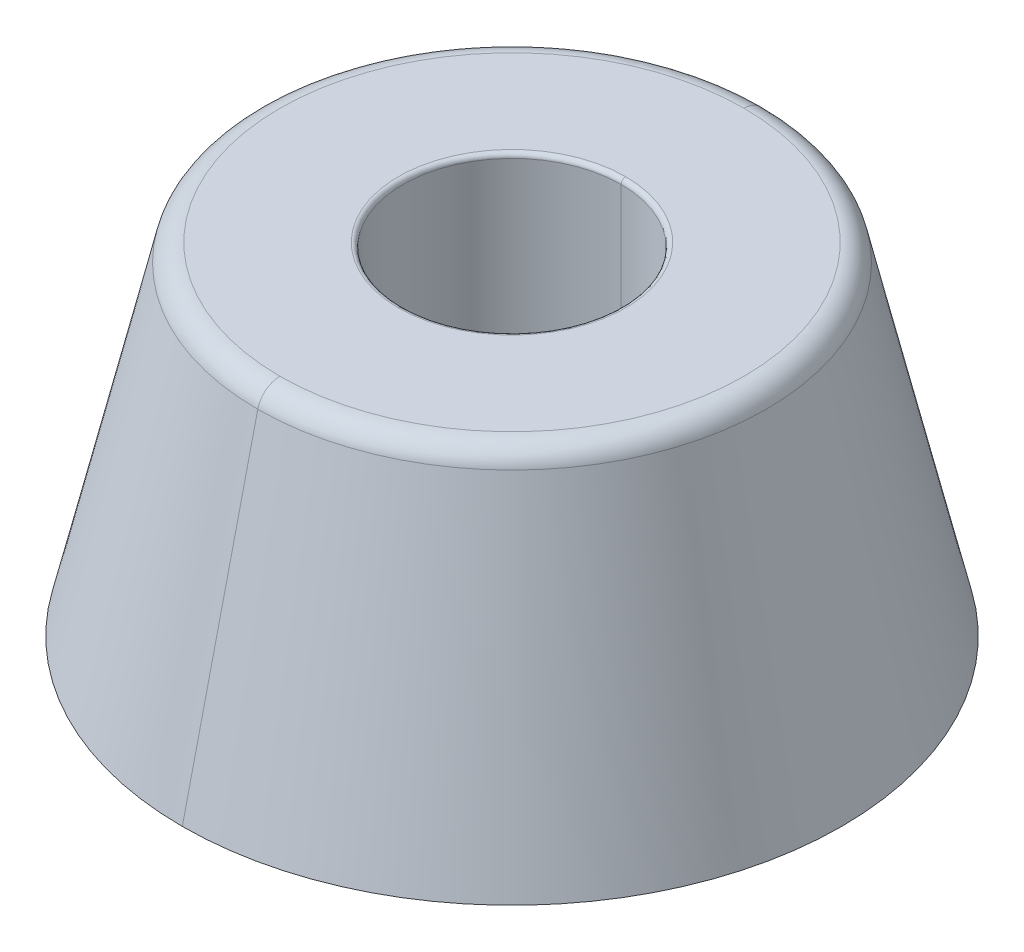
ISO-10303-21;
HEADER;
FILE_DESCRIPTION(('STEP AP214'),'2;1');
FILE_NAME('part.step','',(''),(''),'','','');
FILE_SCHEMA(('AUTOMOTIVE_DESIGN { 1 0 10303 214 1 1 1 1 }'));
ENDSEC;
DATA;
#1=APPLICATION_CONTEXT('core data for automotive mechanical design processes');
#2=APPLICATION_PROTOCOL_DEFINITION('international standard','automotive_design',2000,#1);
#3=PRODUCT_CONTEXT('',#1,'mechanical');
#4=PRODUCT('Part','Part','',(#3));
#5=PRODUCT_RELATED_PRODUCT_CATEGORY('part','',(#4));
#6=PRODUCT_DEFINITION_FORMATION('','',#4);
#7=PRODUCT_DEFINITION_CONTEXT('part definition',#1,'design');
#8=PRODUCT_DEFINITION('design','',#6,#7);
#9=PRODUCT_DEFINITION_SHAPE('','',#8);
#10=(LENGTH_UNIT() NAMED_UNIT(*) SI_UNIT(.MILLI.,.METRE.));
#11=(NAMED_UNIT(*) PLANE_ANGLE_UNIT() SI_UNIT($,.RADIAN.));
#12=(NAMED_UNIT(*) SI_UNIT($,.STERADIAN.) SOLID_ANGLE_UNIT());
#13=UNCERTAINTY_MEASURE_WITH_UNIT(LENGTH_MEASURE(1.E-05),#10,'distance_accuracy_value','');
#14=(GEOMETRIC_REPRESENTATION_CONTEXT(3) GLOBAL_UNCERTAINTY_ASSIGNED_CONTEXT((#13)) GLOBAL_UNIT_ASSIGNED_CONTEXT((#10,
#11,#12)) REPRESENTATION_CONTEXT('',''));
#15=CARTESIAN_POINT('',(0.,0.,0.));
#16=DIRECTION('',(0.,0.,1.));
#17=DIRECTION('',(1.,0.,0.));
#18=AXIS2_PLACEMENT_3D('',#15,#16,#17);
#19=CARTESIAN_POINT('',(0.,14.8,0.));
#20=DIRECTION('',(0.,1.,0.));
#21=DIRECTION('',(0.,0.,1.));
#22=AXIS2_PLACEMENT_3D('',#19,#20,#21);
#23=TOROIDAL_SURFACE('',#22,5.,0.2);
#24=CARTESIAN_POINT('',(0.,14.8,-5.));
#25=DIRECTION('',(1.,0.,0.));
#26=DIRECTION('',(0.,0.,-1.));
#27=AXIS2_PLACEMENT_3D('',#24,#25,#26);
#28=CIRCLE('',#27,0.2);
#29=CARTESIAN_POINT('',(0.,15.,-5.));
#30=VERTEX_POINT('',#29);
#31=CARTESIAN_POINT('',(0.,14.8,-4.8));
#32=VERTEX_POINT('',#31);
#33=EDGE_CURVE('P0_E291',#30,#32,#28,.T.);
#34=ORIENTED_EDGE('',*,*,#33,.F.);
#35=CARTESIAN_POINT('',(0.,15.,0.));
#36=DIRECTION('',(0.,-1.,0.));
#37=DIRECTION('',(0.,0.,1.));
#38=AXIS2_PLACEMENT_3D('',#35,#36,#37);
#39=CIRCLE('',#38,5.);
#40=CARTESIAN_POINT('',(0.,15.,5.));
#41=VERTEX_POINT('',#40);
#42=EDGE_CURVE('P0_E20',#41,#30,#39,.T.);
#43=ORIENTED_EDGE('',*,*,#42,.F.);
#44=CARTESIAN_POINT('',(0.,14.8,5.));
#45=DIRECTION('',(-1.,0.,0.));
#46=DIRECTION('',(0.,0.,1.));
#47=AXIS2_PLACEMENT_3D('',#44,#45,#46);
#48=CIRCLE('',#47,0.2);
#49=CARTESIAN_POINT('',(0.,14.8,4.8));
#50=VERTEX_POINT('',#49);
#51=EDGE_CURVE('P0_E278',#41,#50,#48,.T.);
#52=ORIENTED_EDGE('',*,*,#51,.T.);
#53=CARTESIAN_POINT('',(0.,14.8,0.));
#54=DIRECTION('',(0.,1.,0.));
#55=DIRECTION('',(0.,0.,1.));
#56=AXIS2_PLACEMENT_3D('',#53,#54,#55);
#57=CIRCLE('',#56,4.8);
#58=EDGE_CURVE('P0_E118',#32,#50,#57,.T.);
#59=ORIENTED_EDGE('',*,*,#58,.F.);
#60=EDGE_LOOP('',(#34,#43,#52,#59));
#61=FACE_BOUND('',#60,.T.);
#62=ADVANCED_FACE('P0_F17',(#61),#23,.T.);
#63=CARTESIAN_POINT('',(0.,14.,0.));
#64=DIRECTION('',(0.,1.,0.));
#65=DIRECTION('',(0.,0.,1.));
#66=AXIS2_PLACEMENT_3D('',#63,#64,#65);
#67=TOROIDAL_SURFACE('',#66,10.20647187995,1.);
#68=CARTESIAN_POINT('',(0.,14.,-10.20647187995));
#69=DIRECTION('',(1.,0.,0.));
#70=DIRECTION('',(0.,0.,-1.));
#71=AXIS2_PLACEMENT_3D('',#68,#69,#70);
#72=CIRCLE('',#71,1.);
#73=CARTESIAN_POINT('',(0.,14.2272296156064,-11.1803130896918));
#74=VERTEX_POINT('',#73);
#75=CARTESIAN_POINT('',(0.,15.,-10.20647187995));
#76=VERTEX_POINT('',#75);
#77=EDGE_CURVE('P0_E150',#74,#76,#72,.T.);
#78=ORIENTED_EDGE('',*,*,#77,.F.);
#79=CARTESIAN_POINT('',(0.,14.2272296156064,0.));
#80=DIRECTION('',(0.,-1.,0.));
#81=DIRECTION('',(0.,0.,1.));
#82=AXIS2_PLACEMENT_3D('',#79,#80,#81);
#83=CIRCLE('',#82,11.1803130896918);
#84=CARTESIAN_POINT('',(0.,14.2272296156064,11.1803130896918));
#85=VERTEX_POINT('',#84);
#86=EDGE_CURVE('P0_E93',#85,#74,#83,.T.);
#87=ORIENTED_EDGE('',*,*,#86,.F.);
#88=CARTESIAN_POINT('',(0.,14.,10.20647187995));
#89=DIRECTION('',(-1.,0.,0.));
#90=DIRECTION('',(0.,0.,1.));
#91=AXIS2_PLACEMENT_3D('',#88,#89,#90);
#92=CIRCLE('',#91,1.);
#93=CARTESIAN_POINT('',(0.,15.,10.20647187995));
#94=VERTEX_POINT('',#93);
#95=EDGE_CURVE('P0_E141',#85,#94,#92,.T.);
#96=ORIENTED_EDGE('',*,*,#95,.T.);
#97=CARTESIAN_POINT('',(0.,15.,0.));
#98=DIRECTION('',(0.,1.,0.));
#99=DIRECTION('',(0.,0.,1.));
#100=AXIS2_PLACEMENT_3D('',#97,#98,#99);
#101=CIRCLE('',#100,10.20647187995);
#102=EDGE_CURVE('P0_E130',#76,#94,#101,.T.);
#103=ORIENTED_EDGE('',*,*,#102,.F.);
#104=EDGE_LOOP('',(#78,#87,#96,#103));
#105=FACE_BOUND('',#104,.T.);
#106=ADVANCED_FACE('P0_F142',(#105),#67,.T.);
#107=CARTESIAN_POINT('',(0.,0.,0.));
#108=DIRECTION('',(0.,1.,0.));
#109=DIRECTION('',(0.,0.,1.));
#110=AXIS2_PLACEMENT_3D('',#107,#108,#109);
#111=CYLINDRICAL_SURFACE('',#110,2.6);
#112=DIRECTION('',(0.,1.,0.));
#113=VECTOR('',#112,1.);
#114=CARTESIAN_POINT('',(0.,0.,-2.6));
#115=LINE('',#114,#113);
#116=CARTESIAN_POINT('',(0.,0.,-2.6));
#117=VERTEX_POINT('',#116);
#118=CARTESIAN_POINT('',(0.,7.,-2.6));
#119=VERTEX_POINT('',#118);
#120=EDGE_CURVE('P0_E171',#117,#119,#115,.T.);
#121=ORIENTED_EDGE('',*,*,#120,.F.);
#122=CARTESIAN_POINT('',(0.,0.,0.));
#123=DIRECTION('',(0.,1.,0.));
#124=DIRECTION('',(0.,0.,1.));
#125=AXIS2_PLACEMENT_3D('',#122,#123,#124);
#126=CIRCLE('',#125,2.6);
#127=CARTESIAN_POINT('',(0.,0.,2.6));
#128=VERTEX_POINT('',#127);
#129=EDGE_CURVE('P0_E195',#128,#117,#126,.T.);
#130=ORIENTED_EDGE('',*,*,#129,.F.);
#131=DIRECTION('',(0.,1.,0.));
#132=VECTOR('',#131,1.);
#133=CARTESIAN_POINT('',(0.,0.,2.6));
#134=LINE('',#133,#132);
#135=CARTESIAN_POINT('',(0.,7.,2.6));
#136=VERTEX_POINT('',#135);
#137=EDGE_CURVE('P0_E164',#128,#136,#134,.T.);
#138=ORIENTED_EDGE('',*,*,#137,.T.);
#139=CARTESIAN_POINT('',(0.,7.,0.));
#140=DIRECTION('',(0.,1.,0.));
#141=DIRECTION('',(0.,0.,1.));
#142=AXIS2_PLACEMENT_3D('',#139,#140,#141);
#143=CIRCLE('',#142,2.6);
#144=EDGE_CURVE('P0_E11',#136,#119,#143,.T.);
#145=ORIENTED_EDGE('',*,*,#144,.T.);
#146=EDGE_LOOP('',(#121,#130,#138,#145));
#147=FACE_BOUND('',#146,.T.);
#148=ADVANCED_FACE('P0_F337',(#147),#111,.F.);
#149=CARTESIAN_POINT('',(0.,7.,0.));
#150=DIRECTION('',(0.,1.,0.));
#151=DIRECTION('',(0.,0.,-1.));
#152=AXIS2_PLACEMENT_3D('',#149,#150,#151);
#153=PLANE('',#152);
#154=ORIENTED_EDGE('',*,*,#144,.F.);
#155=CARTESIAN_POINT('',(0.,7.,0.));
#156=DIRECTION('',(0.,1.,0.));
#157=DIRECTION('',(0.,0.,1.));
#158=AXIS2_PLACEMENT_3D('',#155,#156,#157);
#159=CIRCLE('',#158,2.6);
#160=EDGE_CURVE('P0_E168',#119,#136,#159,.T.);
#161=ORIENTED_EDGE('',*,*,#160,.F.);
#162=EDGE_LOOP('',(#154,#161));
#163=FACE_BOUND('',#162,.T.);
#164=CARTESIAN_POINT('',(0.,7.,0.));
#165=DIRECTION('',(0.,1.,0.));
#166=DIRECTION('',(0.,0.,1.));
#167=AXIS2_PLACEMENT_3D('',#164,#165,#166);
#168=CIRCLE('',#167,4.8);
#169=CARTESIAN_POINT('',(0.,7.,4.8));
#170=VERTEX_POINT('',#169);
#171=CARTESIAN_POINT('',(0.,7.,-4.8));
#172=VERTEX_POINT('',#171);
#173=EDGE_CURVE('P0_E26',#170,#172,#168,.T.);
#174=ORIENTED_EDGE('',*,*,#173,.T.);
#175=CARTESIAN_POINT('',(0.,7.,0.));
#176=DIRECTION('',(0.,1.,0.));
#177=DIRECTION('',(0.,0.,1.));
#178=AXIS2_PLACEMENT_3D('',#175,#176,#177);
#179=CIRCLE('',#178,4.8);
#180=EDGE_CURVE('P0_E167',#172,#170,#179,.T.);
#181=ORIENTED_EDGE('',*,*,#180,.T.);
#182=EDGE_LOOP('',(#174,#181));
#183=FACE_BOUND('',#182,.T.);
#184=ADVANCED_FACE('P0_F348',(#163,#183),#153,.T.);
#185=CARTESIAN_POINT('',(0.,7.,0.));
#186=DIRECTION('',(0.,1.,0.));
#187=DIRECTION('',(0.,0.,1.));
#188=AXIS2_PLACEMENT_3D('',#185,#186,#187);
#189=CYLINDRICAL_SURFACE('',#188,4.8);
#190=DIRECTION('',(0.,1.,0.));
#191=VECTOR('',#190,1.);
#192=CARTESIAN_POINT('',(0.,7.,-4.8));
#193=LINE('',#192,#191);
#194=EDGE_CURVE('P0_E163',#172,#32,#193,.T.);
#195=ORIENTED_EDGE('',*,*,#194,.F.);
#196=ORIENTED_EDGE('',*,*,#173,.F.);
#197=DIRECTION('',(0.,1.,0.));
#198=VECTOR('',#197,1.);
#199=CARTESIAN_POINT('',(0.,7.,4.8));
#200=LINE('',#199,#198);
#201=EDGE_CURVE('P0_E106',#170,#50,#200,.T.);
#202=ORIENTED_EDGE('',*,*,#201,.T.);
#203=CARTESIAN_POINT('',(0.,14.8,0.));
#204=DIRECTION('',(0.,1.,0.));
#205=DIRECTION('',(0.,0.,1.));
#206=AXIS2_PLACEMENT_3D('',#203,#204,#205);
#207=CIRCLE('',#206,4.8);
#208=EDGE_CURVE('P0_E281',#50,#32,#207,.T.);
#209=ORIENTED_EDGE('',*,*,#208,.T.);
#210=EDGE_LOOP('',(#195,#196,#202,#209));
#211=FACE_BOUND('',#210,.T.);
#212=ADVANCED_FACE('P0_F330',(#211),#189,.F.);
#213=CARTESIAN_POINT('',(0.,15.,11.));
#214=DIRECTION('',(0.,1.,0.));
#215=DIRECTION('',(0.,0.,-1.));
#216=AXIS2_PLACEMENT_3D('',#213,#214,#215);
#217=PLANE('',#216);
#218=ORIENTED_EDGE('',*,*,#42,.T.);
#219=CARTESIAN_POINT('',(0.,15.,0.));
#220=DIRECTION('',(0.,-1.,0.));
#221=DIRECTION('',(0.,0.,1.));
#222=AXIS2_PLACEMENT_3D('',#219,#220,#221);
#223=CIRCLE('',#222,5.);
#224=EDGE_CURVE('P0_E299',#30,#41,#223,.T.);
#225=ORIENTED_EDGE('',*,*,#224,.T.);
#226=EDGE_LOOP('',(#218,#225));
#227=FACE_BOUND('',#226,.T.);
#228=CARTESIAN_POINT('',(0.,15.,0.));
#229=DIRECTION('',(0.,1.,0.));
#230=DIRECTION('',(0.,0.,1.));
#231=AXIS2_PLACEMENT_3D('',#228,#229,#230);
#232=CIRCLE('',#231,10.20647187995);
#233=EDGE_CURVE('P0_E137',#94,#76,#232,.T.);
#234=ORIENTED_EDGE('',*,*,#233,.T.);
#235=ORIENTED_EDGE('',*,*,#102,.T.);
#236=EDGE_LOOP('',(#234,#235));
#237=FACE_BOUND('',#236,.T.);
#238=ADVANCED_FACE('P0_F135',(#227,#237),#217,.T.);
#239=CARTESIAN_POINT('',(0.,15.,0.));
#240=DIRECTION('',(0.,-1.,0.));
#241=DIRECTION('',(0.,0.,-1.));
#242=AXIS2_PLACEMENT_3D('',#239,#240,#241);
#243=CONICAL_SURFACE('',#242,11.,0.229231933276995);
#244=DIRECTION('',(0.,-0.973841209741793,0.227229615606418));
#245=VECTOR('',#244,1.);
#246=CARTESIAN_POINT('',(0.,15.,11.));
#247=LINE('',#246,#245);
#248=CARTESIAN_POINT('',(0.,0.,14.5));
#249=VERTEX_POINT('',#248);
#250=EDGE_CURVE('P0_E180',#85,#249,#247,.T.);
#251=ORIENTED_EDGE('',*,*,#250,.F.);
#252=ORIENTED_EDGE('',*,*,#86,.T.);
#253=DIRECTION('',(0.,-0.973841209741793,-0.227229615606418));
#254=VECTOR('',#253,1.);
#255=CARTESIAN_POINT('',(0.,15.,-11.));
#256=LINE('',#255,#254);
#257=CARTESIAN_POINT('',(0.,0.,-14.5));
#258=VERTEX_POINT('',#257);
#259=EDGE_CURVE('P0_E190',#74,#258,#256,.T.);
#260=ORIENTED_EDGE('',*,*,#259,.T.);
#261=CARTESIAN_POINT('',(0.,0.,0.));
#262=DIRECTION('',(0.,1.,0.));
#263=DIRECTION('',(0.,0.,1.));
#264=AXIS2_PLACEMENT_3D('',#261,#262,#263);
#265=CIRCLE('',#264,14.5);
#266=EDGE_CURVE('P0_E39',#258,#249,#265,.T.);
#267=ORIENTED_EDGE('',*,*,#266,.T.);
#268=EDGE_LOOP('',(#251,#252,#260,#267));
#269=FACE_BOUND('',#268,.T.);
#270=ADVANCED_FACE('P0_F319',(#269),#243,.T.);
#271=CARTESIAN_POINT('',(0.,0.,0.));
#272=DIRECTION('',(0.,-1.,0.));
#273=DIRECTION('',(0.,0.,-1.));
#274=AXIS2_PLACEMENT_3D('',#271,#272,#273);
#275=PLANE('',#274);
#276=ORIENTED_EDGE('',*,*,#129,.T.);
#277=CARTESIAN_POINT('',(0.,0.,0.));
#278=DIRECTION('',(0.,1.,0.));
#279=DIRECTION('',(0.,0.,1.));
#280=AXIS2_PLACEMENT_3D('',#277,#278,#279);
#281=CIRCLE('',#280,2.6);
#282=EDGE_CURVE('P0_E147',#117,#128,#281,.T.);
#283=ORIENTED_EDGE('',*,*,#282,.T.);
#284=EDGE_LOOP('',(#276,#283));
#285=FACE_BOUND('',#284,.T.);
#286=ORIENTED_EDGE('',*,*,#266,.F.);
#287=CARTESIAN_POINT('',(0.,0.,0.));
#288=DIRECTION('',(0.,1.,0.));
#289=DIRECTION('',(0.,0.,1.));
#290=AXIS2_PLACEMENT_3D('',#287,#288,#289);
#291=CIRCLE('',#290,14.5);
#292=EDGE_CURVE('P0_E184',#249,#258,#291,.T.);
#293=ORIENTED_EDGE('',*,*,#292,.F.);
#294=EDGE_LOOP('',(#286,#293));
#295=FACE_BOUND('',#294,.T.);
#296=ADVANCED_FACE('P0_F321',(#285,#295),#275,.T.);
#297=CARTESIAN_POINT('',(0.,15.,0.));
#298=DIRECTION('',(0.,-1.,0.));
#299=DIRECTION('',(0.,0.,-1.));
#300=AXIS2_PLACEMENT_3D('',#297,#298,#299);
#301=CONICAL_SURFACE('',#300,11.,0.229231933276995);
#302=CARTESIAN_POINT('',(0.,14.2272296156064,0.));
#303=DIRECTION('',(0.,-1.,0.));
#304=DIRECTION('',(0.,0.,1.));
#305=AXIS2_PLACEMENT_3D('',#302,#303,#304);
#306=CIRCLE('',#305,11.1803130896918);
#307=EDGE_CURVE('P0_E157',#74,#85,#306,.T.);
#308=ORIENTED_EDGE('',*,*,#307,.T.);
#309=ORIENTED_EDGE('',*,*,#250,.T.);
#310=ORIENTED_EDGE('',*,*,#292,.T.);
#311=ORIENTED_EDGE('',*,*,#259,.F.);
#312=EDGE_LOOP('',(#308,#309,#310,#311));
#313=FACE_BOUND('',#312,.T.);
#314=ADVANCED_FACE('P0_F318',(#313),#301,.T.);
#315=CARTESIAN_POINT('',(0.,7.,0.));
#316=DIRECTION('',(0.,1.,0.));
#317=DIRECTION('',(0.,0.,1.));
#318=AXIS2_PLACEMENT_3D('',#315,#316,#317);
#319=CYLINDRICAL_SURFACE('',#318,4.8);
#320=ORIENTED_EDGE('',*,*,#180,.F.);
#321=ORIENTED_EDGE('',*,*,#194,.T.);
#322=ORIENTED_EDGE('',*,*,#58,.T.);
#323=ORIENTED_EDGE('',*,*,#201,.F.);
#324=EDGE_LOOP('',(#320,#321,#322,#323));
#325=FACE_BOUND('',#324,.T.);
#326=ADVANCED_FACE('P0_F347',(#325),#319,.F.);
#327=CARTESIAN_POINT('',(0.,0.,0.));
#328=DIRECTION('',(0.,1.,0.));
#329=DIRECTION('',(0.,0.,1.));
#330=AXIS2_PLACEMENT_3D('',#327,#328,#329);
#331=CYLINDRICAL_SURFACE('',#330,2.6);
#332=ORIENTED_EDGE('',*,*,#282,.F.);
#333=ORIENTED_EDGE('',*,*,#120,.T.);
#334=ORIENTED_EDGE('',*,*,#160,.T.);
#335=ORIENTED_EDGE('',*,*,#137,.F.);
#336=EDGE_LOOP('',(#332,#333,#334,#335));
#337=FACE_BOUND('',#336,.T.);
#338=ADVANCED_FACE('P0_F361',(#337),#331,.F.);
#339=CARTESIAN_POINT('',(0.,14.,0.));
#340=DIRECTION('',(0.,1.,0.));
#341=DIRECTION('',(0.,0.,1.));
#342=AXIS2_PLACEMENT_3D('',#339,#340,#341);
#343=TOROIDAL_SURFACE('',#342,10.20647187995,1.);
#344=ORIENTED_EDGE('',*,*,#307,.F.);
#345=ORIENTED_EDGE('',*,*,#77,.T.);
#346=ORIENTED_EDGE('',*,*,#233,.F.);
#347=ORIENTED_EDGE('',*,*,#95,.F.);
#348=EDGE_LOOP('',(#344,#345,#346,#347));
#349=FACE_BOUND('',#348,.T.);
#350=ADVANCED_FACE('P0_F149',(#349),#343,.T.);
#351=CARTESIAN_POINT('',(0.,14.8,0.));
#352=DIRECTION('',(0.,1.,0.));
#353=DIRECTION('',(0.,0.,1.));
#354=AXIS2_PLACEMENT_3D('',#351,#352,#353);
#355=TOROIDAL_SURFACE('',#354,5.,0.2);
#356=ORIENTED_EDGE('',*,*,#224,.F.);
#357=ORIENTED_EDGE('',*,*,#33,.T.);
#358=ORIENTED_EDGE('',*,*,#208,.F.);
#359=ORIENTED_EDGE('',*,*,#51,.F.);
#360=EDGE_LOOP('',(#356,#357,#358,#359));
#361=FACE_BOUND('',#360,.T.);
#362=ADVANCED_FACE('P0_F344',(#361),#355,.T.);
#363=CLOSED_SHELL('',(#62,#106,#148,#184,#212,#238,#270,#296,#314,#326,#338,#350,#362));
#364=MANIFOLD_SOLID_BREP('P0_B1',#363);
#365=CARTESIAN_POINT('',(0.,8.,0.));
#366=DIRECTION('',(0.,-1.,0.));
#367=DIRECTION('',(0.,0.,-1.));
#368=AXIS2_PLACEMENT_3D('',#365,#366,#367);
#369=CYLINDRICAL_SURFACE('',#368,2.6);
#370=DIRECTION('',(0.,-1.,0.));
#371=VECTOR('',#370,1.);
#372=CARTESIAN_POINT('',(0.,8.,2.6));
#373=LINE('',#372,#371);
#374=CARTESIAN_POINT('',(0.,8.,2.6));
#375=VERTEX_POINT('',#374);
#376=CARTESIAN_POINT('',(0.,7.,2.6));
#377=VERTEX_POINT('',#376);
#378=EDGE_CURVE('P1_E127',#375,#377,#373,.T.);
#379=ORIENTED_EDGE('',*,*,#378,.F.);
#380=CARTESIAN_POINT('',(0.,8.,0.));
#381=DIRECTION('',(0.,1.,0.));
#382=DIRECTION('',(0.,0.,1.));
#383=AXIS2_PLACEMENT_3D('',#380,#381,#382);
#384=CIRCLE('',#383,2.6);
#385=CARTESIAN_POINT('',(0.,8.,-2.6));
#386=VERTEX_POINT('',#385);
#387=EDGE_CURVE('P1_E77',#375,#386,#384,.T.);
#388=ORIENTED_EDGE('',*,*,#387,.T.);
#389=DIRECTION('',(0.,-1.,0.));
#390=VECTOR('',#389,1.);
#391=CARTESIAN_POINT('',(0.,8.,-2.6));
#392=LINE('',#391,#390);
#393=CARTESIAN_POINT('',(0.,7.,-2.6));
#394=VERTEX_POINT('',#393);
#395=EDGE_CURVE('P1_E89',#386,#394,#392,.T.);
#396=ORIENTED_EDGE('',*,*,#395,.T.);
#397=CARTESIAN_POINT('',(0.,7.,0.));
#398=DIRECTION('',(0.,1.,0.));
#399=DIRECTION('',(0.,0.,1.));
#400=AXIS2_PLACEMENT_3D('',#397,#398,#399);
#401=CIRCLE('',#400,2.6);
#402=EDGE_CURVE('P1_E11',#377,#394,#401,.T.);
#403=ORIENTED_EDGE('',*,*,#402,.F.);
#404=EDGE_LOOP('',(#379,#388,#396,#403));
#405=FACE_BOUND('',#404,.T.);
#406=ADVANCED_FACE('P1_F18',(#405),#369,.F.);
#407=CARTESIAN_POINT('',(0.,8.,0.));
#408=DIRECTION('',(0.,-1.,0.));
#409=DIRECTION('',(0.,0.,-1.));
#410=AXIS2_PLACEMENT_3D('',#407,#408,#409);
#411=CYLINDRICAL_SURFACE('',#410,4.8);
#412=DIRECTION('',(0.,-1.,0.));
#413=VECTOR('',#412,1.);
#414=CARTESIAN_POINT('',(0.,8.,4.8));
#415=LINE('',#414,#413);
#416=CARTESIAN_POINT('',(0.,8.,4.8));
#417=VERTEX_POINT('',#416);
#418=CARTESIAN_POINT('',(0.,7.,4.8));
#419=VERTEX_POINT('',#418);
#420=EDGE_CURVE('P1_E81',#417,#419,#415,.T.);
#421=ORIENTED_EDGE('',*,*,#420,.F.);
#422=CARTESIAN_POINT('',(0.,8.,0.));
#423=DIRECTION('',(0.,1.,0.));
#424=DIRECTION('',(0.,0.,1.));
#425=AXIS2_PLACEMENT_3D('',#422,#423,#424);
#426=CIRCLE('',#425,4.8);
#427=CARTESIAN_POINT('',(0.,8.,-4.8));
#428=VERTEX_POINT('',#427);
#429=EDGE_CURVE('P1_E71',#428,#417,#426,.T.);
#430=ORIENTED_EDGE('',*,*,#429,.F.);
#431=DIRECTION('',(0.,-1.,0.));
#432=VECTOR('',#431,1.);
#433=CARTESIAN_POINT('',(0.,8.,-4.8));
#434=LINE('',#433,#432);
#435=CARTESIAN_POINT('',(0.,7.,-4.8));
#436=VERTEX_POINT('',#435);
#437=EDGE_CURVE('P1_E78',#428,#436,#434,.T.);
#438=ORIENTED_EDGE('',*,*,#437,.T.);
#439=CARTESIAN_POINT('',(0.,7.,0.));
#440=DIRECTION('',(0.,1.,0.));
#441=DIRECTION('',(0.,0.,1.));
#442=AXIS2_PLACEMENT_3D('',#439,#440,#441);
#443=CIRCLE('',#442,4.8);
#444=EDGE_CURVE('P1_E26',#436,#419,#443,.T.);
#445=ORIENTED_EDGE('',*,*,#444,.T.);
#446=EDGE_LOOP('',(#421,#430,#438,#445));
#447=FACE_BOUND('',#446,.T.);
#448=ADVANCED_FACE('P1_F82',(#447),#411,.T.);
#449=CARTESIAN_POINT('',(0.,7.,0.));
#450=DIRECTION('',(0.,1.,0.));
#451=DIRECTION('',(0.,0.,-1.));
#452=AXIS2_PLACEMENT_3D('',#449,#450,#451);
#453=PLANE('',#452);
#454=CARTESIAN_POINT('',(0.,7.,0.));
#455=DIRECTION('',(0.,1.,0.));
#456=DIRECTION('',(0.,0.,1.));
#457=AXIS2_PLACEMENT_3D('',#454,#455,#456);
#458=CIRCLE('',#457,2.6);
#459=EDGE_CURVE('P1_E96',#394,#377,#458,.T.);
#460=ORIENTED_EDGE('',*,*,#459,.T.);
#461=ORIENTED_EDGE('',*,*,#402,.T.);
#462=EDGE_LOOP('',(#460,#461));
#463=FACE_BOUND('',#462,.T.);
#464=ORIENTED_EDGE('',*,*,#444,.F.);
#465=CARTESIAN_POINT('',(0.,7.,0.));
#466=DIRECTION('',(0.,1.,0.));
#467=DIRECTION('',(0.,0.,1.));
#468=AXIS2_PLACEMENT_3D('',#465,#466,#467);
#469=CIRCLE('',#468,4.8);
#470=EDGE_CURVE('P1_E86',#419,#436,#469,.T.);
#471=ORIENTED_EDGE('',*,*,#470,.F.);
#472=EDGE_LOOP('',(#464,#471));
#473=FACE_BOUND('',#472,.T.);
#474=ADVANCED_FACE('P1_F108',(#463,#473),#453,.F.);
#475=CARTESIAN_POINT('',(0.,8.,0.));
#476=DIRECTION('',(0.,1.,0.));
#477=DIRECTION('',(0.,0.,-1.));
#478=AXIS2_PLACEMENT_3D('',#475,#476,#477);
#479=PLANE('',#478);
#480=CARTESIAN_POINT('',(0.,8.,0.));
#481=DIRECTION('',(0.,1.,0.));
#482=DIRECTION('',(0.,0.,1.));
#483=AXIS2_PLACEMENT_3D('',#480,#481,#482);
#484=CIRCLE('',#483,2.6);
#485=EDGE_CURVE('P1_E133',#386,#375,#484,.T.);
#486=ORIENTED_EDGE('',*,*,#485,.F.);
#487=ORIENTED_EDGE('',*,*,#387,.F.);
#488=EDGE_LOOP('',(#486,#487));
#489=FACE_BOUND('',#488,.T.);
#490=ORIENTED_EDGE('',*,*,#429,.T.);
#491=CARTESIAN_POINT('',(0.,8.,0.));
#492=DIRECTION('',(0.,1.,0.));
#493=DIRECTION('',(0.,0.,1.));
#494=AXIS2_PLACEMENT_3D('',#491,#492,#493);
#495=CIRCLE('',#494,4.8);
#496=EDGE_CURVE('P1_E74',#417,#428,#495,.T.);
#497=ORIENTED_EDGE('',*,*,#496,.T.);
#498=EDGE_LOOP('',(#490,#497));
#499=FACE_BOUND('',#498,.T.);
#500=ADVANCED_FACE('P1_F72',(#489,#499),#479,.T.);
#501=CARTESIAN_POINT('',(0.,8.,0.));
#502=DIRECTION('',(0.,-1.,0.));
#503=DIRECTION('',(0.,0.,-1.));
#504=AXIS2_PLACEMENT_3D('',#501,#502,#503);
#505=CYLINDRICAL_SURFACE('',#504,4.8);
#506=ORIENTED_EDGE('',*,*,#496,.F.);
#507=ORIENTED_EDGE('',*,*,#420,.T.);
#508=ORIENTED_EDGE('',*,*,#470,.T.);
#509=ORIENTED_EDGE('',*,*,#437,.F.);
#510=EDGE_LOOP('',(#506,#507,#508,#509));
#511=FACE_BOUND('',#510,.T.);
#512=ADVANCED_FACE('P1_F87',(#511),#505,.T.);
#513=CARTESIAN_POINT('',(0.,8.,0.));
#514=DIRECTION('',(0.,-1.,0.));
#515=DIRECTION('',(0.,0.,-1.));
#516=AXIS2_PLACEMENT_3D('',#513,#514,#515);
#517=CYLINDRICAL_SURFACE('',#516,2.6);
#518=ORIENTED_EDGE('',*,*,#485,.T.);
#519=ORIENTED_EDGE('',*,*,#378,.T.);
#520=ORIENTED_EDGE('',*,*,#459,.F.);
#521=ORIENTED_EDGE('',*,*,#395,.F.);
#522=EDGE_LOOP('',(#518,#519,#520,#521));
#523=FACE_BOUND('',#522,.T.);
#524=ADVANCED_FACE('P1_F136',(#523),#517,.F.);
#525=CLOSED_SHELL('',(#406,#448,#474,#500,#512,#524));
#526=MANIFOLD_SOLID_BREP('P1_B1',#525);
#527=ADVANCED_BREP_SHAPE_REPRESENTATION('',(#18,#364,#526),#14);
#528=SHAPE_DEFINITION_REPRESENTATION(#9,#527);
ENDSEC;
END-ISO-10303-21;
